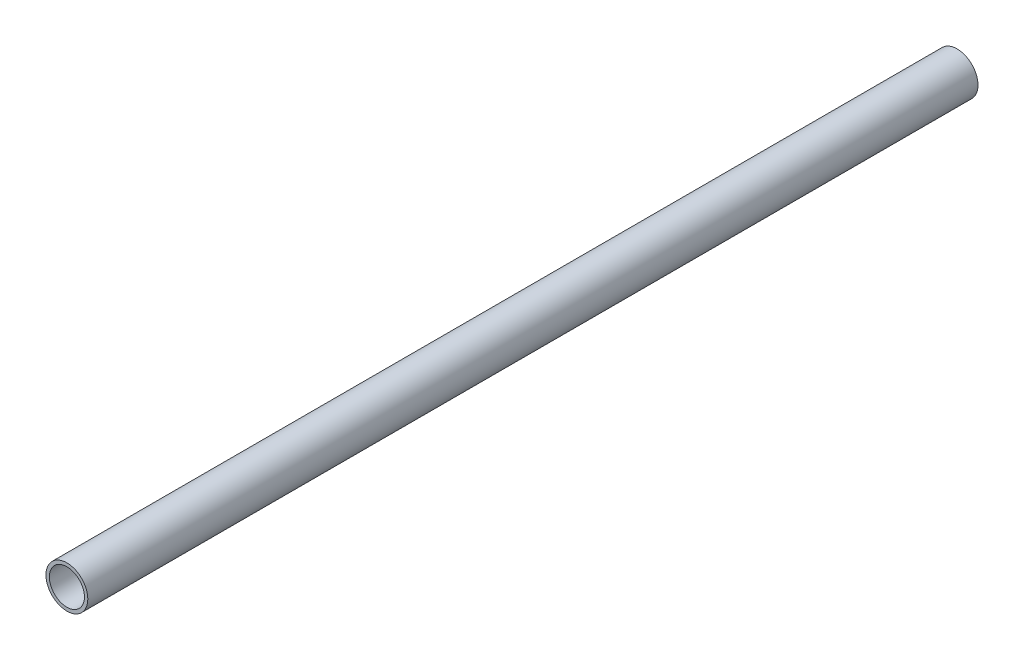
ISO-10303-21;
HEADER;
FILE_DESCRIPTION(('STEP AP214'),'2;1');
FILE_NAME('part.step','',(''),(''),'','','');
FILE_SCHEMA(('AUTOMOTIVE_DESIGN { 1 0 10303 214 1 1 1 1 }'));
ENDSEC;
DATA;
#1=APPLICATION_CONTEXT('core data for automotive mechanical design processes');
#2=APPLICATION_PROTOCOL_DEFINITION('international standard','automotive_design',2000,#1);
#3=PRODUCT_CONTEXT('',#1,'mechanical');
#4=PRODUCT('Part','Part','',(#3));
#5=PRODUCT_RELATED_PRODUCT_CATEGORY('part','',(#4));
#6=PRODUCT_DEFINITION_FORMATION('','',#4);
#7=PRODUCT_DEFINITION_CONTEXT('part definition',#1,'design');
#8=PRODUCT_DEFINITION('design','',#6,#7);
#9=PRODUCT_DEFINITION_SHAPE('','',#8);
#10=(LENGTH_UNIT() NAMED_UNIT(*) SI_UNIT(.MILLI.,.METRE.));
#11=(NAMED_UNIT(*) PLANE_ANGLE_UNIT() SI_UNIT($,.RADIAN.));
#12=(NAMED_UNIT(*) SI_UNIT($,.STERADIAN.) SOLID_ANGLE_UNIT());
#13=UNCERTAINTY_MEASURE_WITH_UNIT(LENGTH_MEASURE(1.E-05),#10,'distance_accuracy_value','');
#14=(GEOMETRIC_REPRESENTATION_CONTEXT(3) GLOBAL_UNCERTAINTY_ASSIGNED_CONTEXT((#13)) GLOBAL_UNIT_ASSIGNED_CONTEXT((#10,
#11,#12)) REPRESENTATION_CONTEXT('',''));
#15=CARTESIAN_POINT('',(0.,0.,0.));
#16=DIRECTION('',(0.,0.,1.));
#17=DIRECTION('',(1.,0.,0.));
#18=AXIS2_PLACEMENT_3D('',#15,#16,#17);
#19=CARTESIAN_POINT('',(0.,0.,-362.137116404284));
#20=DIRECTION('',(0.,0.,1.));
#21=DIRECTION('',(1.,0.,0.));
#22=AXIS2_PLACEMENT_3D('',#19,#20,#21);
#23=CYLINDRICAL_SURFACE('',#22,8.35);
#24=CARTESIAN_POINT('',(0.,0.,-338.519749912654));
#25=DIRECTION('',(0.,0.,-1.));
#26=DIRECTION('',(0.,1.,0.));
#27=AXIS2_PLACEMENT_3D('',#24,#25,#26);
#28=CIRCLE('',#27,8.35);
#29=CARTESIAN_POINT('',(0.,8.35,-338.519749912654));
#30=VERTEX_POINT('',#29);
#31=EDGE_CURVE('E36',#30,#30,#28,.F.);
#32=ORIENTED_EDGE('',*,*,#31,.T.);
#33=EDGE_LOOP('',(#32));
#34=FACE_BOUND('',#33,.T.);
#35=CARTESIAN_POINT('',(0.,0.,16.7));
#36=DIRECTION('',(0.,0.,1.));
#37=DIRECTION('',(1.,0.,0.));
#38=AXIS2_PLACEMENT_3D('',#35,#36,#37);
#39=CIRCLE('',#38,8.35);
#40=CARTESIAN_POINT('',(8.35,0.,16.7));
#41=VERTEX_POINT('',#40);
#42=EDGE_CURVE('E43',#41,#41,#39,.T.);
#43=ORIENTED_EDGE('',*,*,#42,.F.);
#44=EDGE_LOOP('',(#43));
#45=FACE_BOUND('',#44,.T.);
#46=ADVANCED_FACE('F32',(#34,#45),#23,.T.);
#47=CARTESIAN_POINT('',(0.,0.,-362.137116404284));
#48=DIRECTION('',(0.,0.,1.));
#49=DIRECTION('',(1.,0.,0.));
#50=AXIS2_PLACEMENT_3D('',#47,#48,#49);
#51=CYLINDRICAL_SURFACE('',#50,7.);
#52=CARTESIAN_POINT('',(0.,0.,-338.519749912654));
#53=DIRECTION('',(0.,0.,-1.));
#54=DIRECTION('',(0.,1.,0.));
#55=AXIS2_PLACEMENT_3D('',#52,#53,#54);
#56=CIRCLE('',#55,7.);
#57=CARTESIAN_POINT('',(0.,7.,-338.519749912654));
#58=VERTEX_POINT('',#57);
#59=EDGE_CURVE('E10',#58,#58,#56,.F.);
#60=ORIENTED_EDGE('',*,*,#59,.F.);
#61=EDGE_LOOP('',(#60));
#62=FACE_BOUND('',#61,.T.);
#63=CARTESIAN_POINT('',(0.,0.,16.7));
#64=DIRECTION('',(0.,0.,1.));
#65=DIRECTION('',(1.,0.,0.));
#66=AXIS2_PLACEMENT_3D('',#63,#64,#65);
#67=CIRCLE('',#66,7.);
#68=CARTESIAN_POINT('',(7.,0.,16.7));
#69=VERTEX_POINT('',#68);
#70=EDGE_CURVE('E47',#69,#69,#67,.T.);
#71=ORIENTED_EDGE('',*,*,#70,.T.);
#72=EDGE_LOOP('',(#71));
#73=FACE_BOUND('',#72,.T.);
#74=ADVANCED_FACE('F51',(#62,#73),#51,.F.);
#75=CARTESIAN_POINT('',(-6.52338893660513,7.18508541019821,-338.519749912654));
#76=DIRECTION('',(0.,0.,-1.));
#77=DIRECTION('',(-0.166325207885093,-0.986070953441982,0.));
#78=AXIS2_PLACEMENT_3D('',#75,#76,#77);
#79=PLANE('',#78);
#80=ORIENTED_EDGE('',*,*,#31,.F.);
#81=EDGE_LOOP('',(#80));
#82=FACE_BOUND('',#81,.T.);
#83=ORIENTED_EDGE('',*,*,#59,.T.);
#84=EDGE_LOOP('',(#83));
#85=FACE_BOUND('',#84,.T.);
#86=ADVANCED_FACE('F34',(#82,#85),#79,.T.);
#87=CARTESIAN_POINT('',(0.,0.,16.7));
#88=DIRECTION('',(0.,0.,1.));
#89=DIRECTION('',(1.,0.,0.));
#90=AXIS2_PLACEMENT_3D('',#87,#88,#89);
#91=PLANE('',#90);
#92=ORIENTED_EDGE('',*,*,#42,.T.);
#93=EDGE_LOOP('',(#92));
#94=FACE_BOUND('',#93,.T.);
#95=ORIENTED_EDGE('',*,*,#70,.F.);
#96=EDGE_LOOP('',(#95));
#97=FACE_BOUND('',#96,.T.);
#98=ADVANCED_FACE('F53',(#94,#97),#91,.T.);
#99=CLOSED_SHELL('',(#46,#74,#86,#98));
#100=MANIFOLD_SOLID_BREP('B2',#99);
#101=ADVANCED_BREP_SHAPE_REPRESENTATION('',(#18,#100),#14);
#102=SHAPE_DEFINITION_REPRESENTATION(#9,#101);
ENDSEC;
END-ISO-10303-21;
